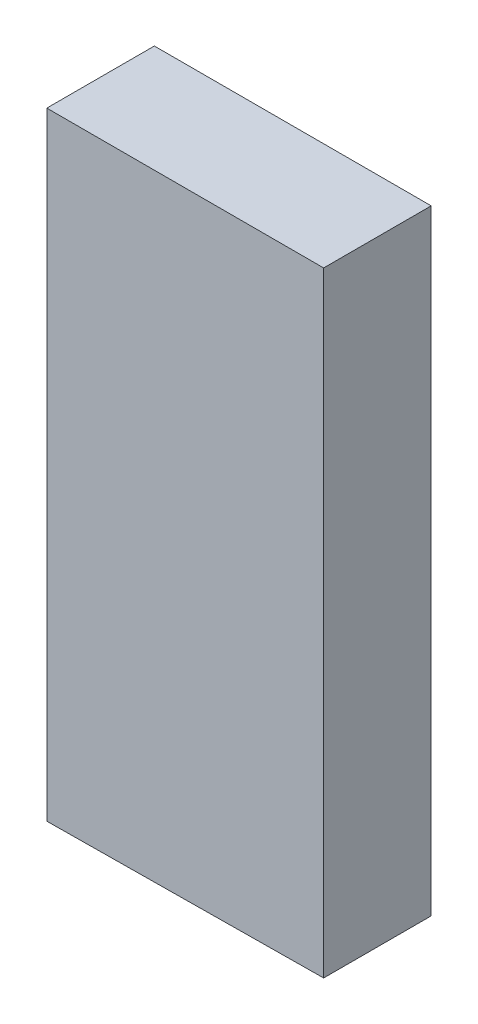
ISO-10303-21;
HEADER;
FILE_DESCRIPTION(('STEP AP214'),'2;1');
FILE_NAME('part.step','',(''),(''),'','','');
FILE_SCHEMA(('AUTOMOTIVE_DESIGN { 1 0 10303 214 1 1 1 1 }'));
ENDSEC;
DATA;
#1=APPLICATION_CONTEXT('core data for automotive mechanical design processes');
#2=APPLICATION_PROTOCOL_DEFINITION('international standard','automotive_design',2000,#1);
#3=PRODUCT_CONTEXT('',#1,'mechanical');
#4=PRODUCT('Part','Part','',(#3));
#5=PRODUCT_RELATED_PRODUCT_CATEGORY('part','',(#4));
#6=PRODUCT_DEFINITION_FORMATION('','',#4);
#7=PRODUCT_DEFINITION_CONTEXT('part definition',#1,'design');
#8=PRODUCT_DEFINITION('design','',#6,#7);
#9=PRODUCT_DEFINITION_SHAPE('','',#8);
#10=(LENGTH_UNIT() NAMED_UNIT(*) SI_UNIT(.MILLI.,.METRE.));
#11=(NAMED_UNIT(*) PLANE_ANGLE_UNIT() SI_UNIT($,.RADIAN.));
#12=(NAMED_UNIT(*) SI_UNIT($,.STERADIAN.) SOLID_ANGLE_UNIT());
#13=UNCERTAINTY_MEASURE_WITH_UNIT(LENGTH_MEASURE(1.E-05),#10,'distance_accuracy_value','');
#14=(GEOMETRIC_REPRESENTATION_CONTEXT(3) GLOBAL_UNCERTAINTY_ASSIGNED_CONTEXT((#13)) GLOBAL_UNIT_ASSIGNED_CONTEXT((#10,
#11,#12)) REPRESENTATION_CONTEXT('',''));
#15=CARTESIAN_POINT('',(0.,0.,0.));
#16=DIRECTION('',(0.,0.,1.));
#17=DIRECTION('',(1.,0.,0.));
#18=AXIS2_PLACEMENT_3D('',#15,#16,#17);
#19=CARTESIAN_POINT('',(-0.6499987,-1.44999964,0.50499772));
#20=DIRECTION('',(0.,0.,1.));
#21=DIRECTION('',(1.,0.,0.));
#22=AXIS2_PLACEMENT_3D('',#19,#20,#21);
#23=PLANE('',#22);
#24=DIRECTION('',(0.,1.,0.));
#25=VECTOR('',#24,1.);
#26=CARTESIAN_POINT('',(-0.6499987,-1.44999964,0.50499772));
#27=LINE('',#26,#25);
#28=CARTESIAN_POINT('',(-0.6499987,-1.44999964,0.50499772));
#29=VERTEX_POINT('',#28);
#30=CARTESIAN_POINT('',(-0.6499987,1.44999964,0.50499772));
#31=VERTEX_POINT('',#30);
#32=EDGE_CURVE('E97',#29,#31,#27,.T.);
#33=ORIENTED_EDGE('',*,*,#32,.F.);
#34=DIRECTION('',(-0.999954509921288,-0.00953824344815175,0.));
#35=VECTOR('',#34,1.);
#36=CARTESIAN_POINT('',(0.65000124,-1.43759936,0.50499772));
#37=LINE('',#36,#35);
#38=CARTESIAN_POINT('',(0.65000124,-1.43759936,0.50499772));
#39=VERTEX_POINT('',#38);
#40=EDGE_CURVE('E27',#39,#29,#37,.T.);
#41=ORIENTED_EDGE('',*,*,#40,.F.);
#42=DIRECTION('',(0.,-1.,0.));
#43=VECTOR('',#42,1.);
#44=CARTESIAN_POINT('',(0.65000124,1.44999964,0.50499772));
#45=LINE('',#44,#43);
#46=CARTESIAN_POINT('',(0.65000124,1.44999964,0.50499772));
#47=VERTEX_POINT('',#46);
#48=EDGE_CURVE('E63',#47,#39,#45,.T.);
#49=ORIENTED_EDGE('',*,*,#48,.F.);
#50=DIRECTION('',(1.,0.,0.));
#51=VECTOR('',#50,1.);
#52=CARTESIAN_POINT('',(-0.6499987,1.44999964,0.50499772));
#53=LINE('',#52,#51);
#54=EDGE_CURVE('E93',#31,#47,#53,.T.);
#55=ORIENTED_EDGE('',*,*,#54,.F.);
#56=EDGE_LOOP('',(#33,#41,#49,#55));
#57=FACE_BOUND('',#56,.T.);
#58=ADVANCED_FACE('F17',(#57),#23,.T.);
#59=CARTESIAN_POINT('',(-0.6499987,-1.44999964,0.));
#60=DIRECTION('',(0.,0.,1.));
#61=DIRECTION('',(1.,0.,0.));
#62=AXIS2_PLACEMENT_3D('',#59,#60,#61);
#63=PLANE('',#62);
#64=DIRECTION('',(0.,1.,0.));
#65=VECTOR('',#64,1.);
#66=CARTESIAN_POINT('',(-0.6499987,-1.44999964,0.));
#67=LINE('',#66,#65);
#68=CARTESIAN_POINT('',(-0.6499987,-1.44999964,0.));
#69=VERTEX_POINT('',#68);
#70=CARTESIAN_POINT('',(-0.6499987,1.44999964,0.));
#71=VERTEX_POINT('',#70);
#72=EDGE_CURVE('E83',#69,#71,#67,.T.);
#73=ORIENTED_EDGE('',*,*,#72,.T.);
#74=DIRECTION('',(1.,0.,0.));
#75=VECTOR('',#74,1.);
#76=CARTESIAN_POINT('',(-0.6499987,1.44999964,0.));
#77=LINE('',#76,#75);
#78=CARTESIAN_POINT('',(0.65000124,1.44999964,0.));
#79=VERTEX_POINT('',#78);
#80=EDGE_CURVE('E75',#71,#79,#77,.T.);
#81=ORIENTED_EDGE('',*,*,#80,.T.);
#82=DIRECTION('',(0.,-1.,0.));
#83=VECTOR('',#82,1.);
#84=CARTESIAN_POINT('',(0.65000124,1.44999964,0.));
#85=LINE('',#84,#83);
#86=CARTESIAN_POINT('',(0.65000124,-1.43759936,0.));
#87=VERTEX_POINT('',#86);
#88=EDGE_CURVE('E85',#79,#87,#85,.T.);
#89=ORIENTED_EDGE('',*,*,#88,.T.);
#90=DIRECTION('',(-0.999954509921288,-0.00953824344815175,0.));
#91=VECTOR('',#90,1.);
#92=CARTESIAN_POINT('',(0.65000124,-1.43759936,0.));
#93=LINE('',#92,#91);
#94=EDGE_CURVE('E11',#87,#69,#93,.T.);
#95=ORIENTED_EDGE('',*,*,#94,.T.);
#96=EDGE_LOOP('',(#73,#81,#89,#95));
#97=FACE_BOUND('',#96,.T.);
#98=ADVANCED_FACE('F82',(#97),#63,.F.);
#99=CARTESIAN_POINT('',(0.65000124,-1.43759936,0.));
#100=DIRECTION('',(0.00953824344815175,-0.999954509921288,0.));
#101=DIRECTION('',(0.,0.,-1.));
#102=AXIS2_PLACEMENT_3D('',#99,#100,#101);
#103=PLANE('',#102);
#104=DIRECTION('',(0.,0.,1.));
#105=VECTOR('',#104,1.);
#106=CARTESIAN_POINT('',(0.65000124,-1.43759936,0.));
#107=LINE('',#106,#105);
#108=EDGE_CURVE('E106',#87,#39,#107,.T.);
#109=ORIENTED_EDGE('',*,*,#108,.T.);
#110=ORIENTED_EDGE('',*,*,#40,.T.);
#111=DIRECTION('',(0.,0.,1.));
#112=VECTOR('',#111,1.);
#113=CARTESIAN_POINT('',(-0.6499987,-1.44999964,0.));
#114=LINE('',#113,#112);
#115=EDGE_CURVE('E90',#69,#29,#114,.T.);
#116=ORIENTED_EDGE('',*,*,#115,.F.);
#117=ORIENTED_EDGE('',*,*,#94,.F.);
#118=EDGE_LOOP('',(#109,#110,#116,#117));
#119=FACE_BOUND('',#118,.T.);
#120=ADVANCED_FACE('F95',(#119),#103,.T.);
#121=CARTESIAN_POINT('',(0.65000124,1.44999964,0.));
#122=DIRECTION('',(1.,0.,0.));
#123=DIRECTION('',(0.,1.,0.));
#124=AXIS2_PLACEMENT_3D('',#121,#122,#123);
#125=PLANE('',#124);
#126=DIRECTION('',(0.,0.,1.));
#127=VECTOR('',#126,1.);
#128=CARTESIAN_POINT('',(0.65000124,1.44999964,0.));
#129=LINE('',#128,#127);
#130=EDGE_CURVE('E21',#79,#47,#129,.T.);
#131=ORIENTED_EDGE('',*,*,#130,.T.);
#132=ORIENTED_EDGE('',*,*,#48,.T.);
#133=ORIENTED_EDGE('',*,*,#108,.F.);
#134=ORIENTED_EDGE('',*,*,#88,.F.);
#135=EDGE_LOOP('',(#131,#132,#133,#134));
#136=FACE_BOUND('',#135,.T.);
#137=ADVANCED_FACE('F137',(#136),#125,.T.);
#138=CARTESIAN_POINT('',(-0.6499987,1.44999964,0.));
#139=DIRECTION('',(0.,1.,0.));
#140=DIRECTION('',(1.,0.,0.));
#141=AXIS2_PLACEMENT_3D('',#138,#139,#140);
#142=PLANE('',#141);
#143=DIRECTION('',(0.,0.,1.));
#144=VECTOR('',#143,1.);
#145=CARTESIAN_POINT('',(-0.6499987,1.44999964,0.));
#146=LINE('',#145,#144);
#147=EDGE_CURVE('E91',#71,#31,#146,.T.);
#148=ORIENTED_EDGE('',*,*,#147,.T.);
#149=ORIENTED_EDGE('',*,*,#54,.T.);
#150=ORIENTED_EDGE('',*,*,#130,.F.);
#151=ORIENTED_EDGE('',*,*,#80,.F.);
#152=EDGE_LOOP('',(#148,#149,#150,#151));
#153=FACE_BOUND('',#152,.T.);
#154=ADVANCED_FACE('F125',(#153),#142,.T.);
#155=CARTESIAN_POINT('',(-0.6499987,-1.44999964,0.));
#156=DIRECTION('',(-1.,0.,0.));
#157=DIRECTION('',(0.,0.,1.));
#158=AXIS2_PLACEMENT_3D('',#155,#156,#157);
#159=PLANE('',#158);
#160=ORIENTED_EDGE('',*,*,#115,.T.);
#161=ORIENTED_EDGE('',*,*,#32,.T.);
#162=ORIENTED_EDGE('',*,*,#147,.F.);
#163=ORIENTED_EDGE('',*,*,#72,.F.);
#164=EDGE_LOOP('',(#160,#161,#162,#163));
#165=FACE_BOUND('',#164,.T.);
#166=ADVANCED_FACE('F19',(#165),#159,.T.);
#167=CLOSED_SHELL('',(#58,#98,#120,#137,#154,#166));
#168=MANIFOLD_SOLID_BREP('B1',#167);
#169=ADVANCED_BREP_SHAPE_REPRESENTATION('',(#18,#168),#14);
#170=SHAPE_DEFINITION_REPRESENTATION(#9,#169);
ENDSEC;
END-ISO-10303-21;
